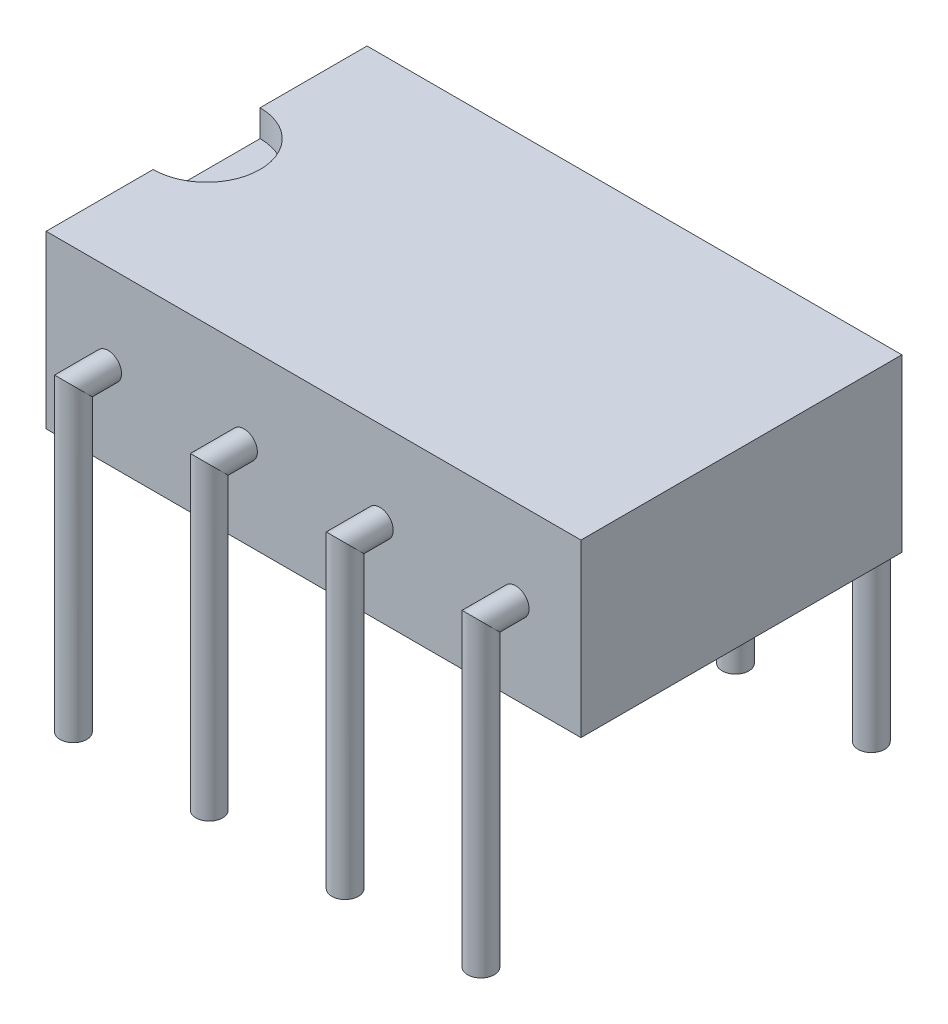
ISO-10303-21;
HEADER;
FILE_DESCRIPTION(('STEP AP214'),'2;1');
FILE_NAME('part.step','',(''),(''),'','','');
FILE_SCHEMA(('AUTOMOTIVE_DESIGN { 1 0 10303 214 1 1 1 1 }'));
ENDSEC;
DATA;
#1=APPLICATION_CONTEXT('core data for automotive mechanical design processes');
#2=APPLICATION_PROTOCOL_DEFINITION('international standard','automotive_design',2000,#1);
#3=PRODUCT_CONTEXT('',#1,'mechanical');
#4=PRODUCT('Part','Part','',(#3));
#5=PRODUCT_RELATED_PRODUCT_CATEGORY('part','',(#4));
#6=PRODUCT_DEFINITION_FORMATION('','',#4);
#7=PRODUCT_DEFINITION_CONTEXT('part definition',#1,'design');
#8=PRODUCT_DEFINITION('design','',#6,#7);
#9=PRODUCT_DEFINITION_SHAPE('','',#8);
#10=(LENGTH_UNIT() NAMED_UNIT(*) SI_UNIT(.MILLI.,.METRE.));
#11=(NAMED_UNIT(*) PLANE_ANGLE_UNIT() SI_UNIT($,.RADIAN.));
#12=(NAMED_UNIT(*) SI_UNIT($,.STERADIAN.) SOLID_ANGLE_UNIT());
#13=UNCERTAINTY_MEASURE_WITH_UNIT(LENGTH_MEASURE(1.E-05),#10,'distance_accuracy_value','');
#14=(GEOMETRIC_REPRESENTATION_CONTEXT(3) GLOBAL_UNCERTAINTY_ASSIGNED_CONTEXT((#13)) GLOBAL_UNIT_ASSIGNED_CONTEXT((#10,
#11,#12)) REPRESENTATION_CONTEXT('',''));
#15=CARTESIAN_POINT('',(0.,0.,0.));
#16=DIRECTION('',(0.,0.,1.));
#17=DIRECTION('',(1.,0.,0.));
#18=AXIS2_PLACEMENT_3D('',#15,#16,#17);
#19=CARTESIAN_POINT('',(10.,3.2,3.));
#20=DIRECTION('',(0.,0.,-1.));
#21=DIRECTION('',(-1.,0.,0.));
#22=AXIS2_PLACEMENT_3D('',#19,#20,#21);
#23=PLANE('',#22);
#24=CARTESIAN_POINT('',(6.24,1.6,3.));
#25=DIRECTION('',(0.,0.,-1.));
#26=DIRECTION('',(-1.,0.,0.));
#27=AXIS2_PLACEMENT_3D('',#24,#25,#26);
#28=CIRCLE('',#27,0.25);
#29=CARTESIAN_POINT('',(5.99,1.6,3.));
#30=VERTEX_POINT('',#29);
#31=EDGE_CURVE('E43',#30,#30,#28,.F.);
#32=ORIENTED_EDGE('',*,*,#31,.F.);
#33=EDGE_LOOP('',(#32));
#34=FACE_BOUND('',#33,.T.);
#35=CARTESIAN_POINT('',(1.16,1.6,3.));
#36=DIRECTION('',(0.,0.,1.));
#37=DIRECTION('',(1.,0.,0.));
#38=AXIS2_PLACEMENT_3D('',#35,#36,#37);
#39=CIRCLE('',#38,0.25);
#40=CARTESIAN_POINT('',(1.41,1.6,3.));
#41=VERTEX_POINT('',#40);
#42=EDGE_CURVE('E134',#41,#41,#39,.T.);
#43=ORIENTED_EDGE('',*,*,#42,.F.);
#44=EDGE_LOOP('',(#43));
#45=FACE_BOUND('',#44,.T.);
#46=DIRECTION('',(0.,-1.,0.));
#47=VECTOR('',#46,1.);
#48=CARTESIAN_POINT('',(0.,3.2,3.));
#49=LINE('',#48,#47);
#50=CARTESIAN_POINT('',(0.,3.2,3.));
#51=VERTEX_POINT('',#50);
#52=CARTESIAN_POINT('',(0.,0.,3.));
#53=VERTEX_POINT('',#52);
#54=EDGE_CURVE('E153',#51,#53,#49,.T.);
#55=ORIENTED_EDGE('',*,*,#54,.T.);
#56=DIRECTION('',(-1.,0.,0.));
#57=VECTOR('',#56,1.);
#58=CARTESIAN_POINT('',(10.,0.,3.));
#59=LINE('',#58,#57);
#60=CARTESIAN_POINT('',(10.,0.,3.));
#61=VERTEX_POINT('',#60);
#62=EDGE_CURVE('E131',#61,#53,#59,.T.);
#63=ORIENTED_EDGE('',*,*,#62,.F.);
#64=DIRECTION('',(0.,-1.,0.));
#65=VECTOR('',#64,1.);
#66=CARTESIAN_POINT('',(10.,3.2,3.));
#67=LINE('',#66,#65);
#68=CARTESIAN_POINT('',(10.,3.2,3.));
#69=VERTEX_POINT('',#68);
#70=EDGE_CURVE('E111',#69,#61,#67,.T.);
#71=ORIENTED_EDGE('',*,*,#70,.F.);
#72=DIRECTION('',(-1.,0.,0.));
#73=VECTOR('',#72,1.);
#74=CARTESIAN_POINT('',(10.,3.2,3.));
#75=LINE('',#74,#73);
#76=EDGE_CURVE('E124',#69,#51,#75,.T.);
#77=ORIENTED_EDGE('',*,*,#76,.T.);
#78=EDGE_LOOP('',(#55,#63,#71,#77));
#79=FACE_BOUND('',#78,.T.);
#80=CARTESIAN_POINT('',(3.7,1.6,3.));
#81=DIRECTION('',(0.,0.,-1.));
#82=DIRECTION('',(-1.,0.,0.));
#83=AXIS2_PLACEMENT_3D('',#80,#81,#82);
#84=CIRCLE('',#83,0.25);
#85=CARTESIAN_POINT('',(3.45,1.6,3.));
#86=VERTEX_POINT('',#85);
#87=EDGE_CURVE('E135',#86,#86,#84,.F.);
#88=ORIENTED_EDGE('',*,*,#87,.F.);
#89=EDGE_LOOP('',(#88));
#90=FACE_BOUND('',#89,.T.);
#91=CARTESIAN_POINT('',(8.78,1.6,3.));
#92=DIRECTION('',(0.,0.,-1.));
#93=DIRECTION('',(-1.,0.,0.));
#94=AXIS2_PLACEMENT_3D('',#91,#92,#93);
#95=CIRCLE('',#94,0.25);
#96=CARTESIAN_POINT('',(8.53,1.6,3.));
#97=VERTEX_POINT('',#96);
#98=EDGE_CURVE('E12',#97,#97,#95,.F.);
#99=ORIENTED_EDGE('',*,*,#98,.F.);
#100=EDGE_LOOP('',(#99));
#101=FACE_BOUND('',#100,.T.);
#102=ADVANCED_FACE('F36',(#34,#45,#79,#90,#101),#23,.F.);
#103=CARTESIAN_POINT('',(10.,0.,3.));
#104=DIRECTION('',(0.,1.,0.));
#105=DIRECTION('',(0.,0.,1.));
#106=AXIS2_PLACEMENT_3D('',#103,#104,#105);
#107=PLANE('',#106);
#108=DIRECTION('',(0.,0.,-1.));
#109=VECTOR('',#108,1.);
#110=CARTESIAN_POINT('',(0.,0.,3.));
#111=LINE('',#110,#109);
#112=CARTESIAN_POINT('',(0.,0.,-3.));
#113=VERTEX_POINT('',#112);
#114=EDGE_CURVE('E208',#53,#113,#111,.T.);
#115=ORIENTED_EDGE('',*,*,#114,.T.);
#116=DIRECTION('',(-1.,0.,0.));
#117=VECTOR('',#116,1.);
#118=CARTESIAN_POINT('',(10.,0.,-3.));
#119=LINE('',#118,#117);
#120=CARTESIAN_POINT('',(10.,0.,-3.));
#121=VERTEX_POINT('',#120);
#122=EDGE_CURVE('E128',#121,#113,#119,.T.);
#123=ORIENTED_EDGE('',*,*,#122,.F.);
#124=DIRECTION('',(0.,0.,-1.));
#125=VECTOR('',#124,1.);
#126=CARTESIAN_POINT('',(10.,0.,3.));
#127=LINE('',#126,#125);
#128=EDGE_CURVE('E114',#61,#121,#127,.T.);
#129=ORIENTED_EDGE('',*,*,#128,.F.);
#130=ORIENTED_EDGE('',*,*,#62,.T.);
#131=EDGE_LOOP('',(#115,#123,#129,#130));
#132=FACE_BOUND('',#131,.T.);
#133=ADVANCED_FACE('F145',(#132),#107,.F.);
#134=CARTESIAN_POINT('',(10.,3.2,-3.));
#135=DIRECTION('',(0.,0.,1.));
#136=DIRECTION('',(1.,0.,0.));
#137=AXIS2_PLACEMENT_3D('',#134,#135,#136);
#138=PLANE('',#137);
#139=CARTESIAN_POINT('',(8.78,1.6,-3.));
#140=DIRECTION('',(0.,0.,1.));
#141=DIRECTION('',(1.,0.,0.));
#142=AXIS2_PLACEMENT_3D('',#139,#140,#141);
#143=CIRCLE('',#142,0.25);
#144=CARTESIAN_POINT('',(9.03,1.6,-3.));
#145=VERTEX_POINT('',#144);
#146=EDGE_CURVE('E457',#145,#145,#143,.T.);
#147=ORIENTED_EDGE('',*,*,#146,.T.);
#148=EDGE_LOOP('',(#147));
#149=FACE_BOUND('',#148,.T.);
#150=CARTESIAN_POINT('',(6.24,1.6,-3.));
#151=DIRECTION('',(0.,0.,1.));
#152=DIRECTION('',(1.,0.,0.));
#153=AXIS2_PLACEMENT_3D('',#150,#151,#152);
#154=CIRCLE('',#153,0.25);
#155=CARTESIAN_POINT('',(6.49,1.6,-3.));
#156=VERTEX_POINT('',#155);
#157=EDGE_CURVE('E450',#156,#156,#154,.T.);
#158=ORIENTED_EDGE('',*,*,#157,.T.);
#159=EDGE_LOOP('',(#158));
#160=FACE_BOUND('',#159,.T.);
#161=CARTESIAN_POINT('',(3.7,1.6,-3.));
#162=DIRECTION('',(0.,0.,1.));
#163=DIRECTION('',(1.,0.,0.));
#164=AXIS2_PLACEMENT_3D('',#161,#162,#163);
#165=CIRCLE('',#164,0.25);
#166=CARTESIAN_POINT('',(3.95,1.6,-3.));
#167=VERTEX_POINT('',#166);
#168=EDGE_CURVE('E466',#167,#167,#165,.T.);
#169=ORIENTED_EDGE('',*,*,#168,.T.);
#170=EDGE_LOOP('',(#169));
#171=FACE_BOUND('',#170,.T.);
#172=CARTESIAN_POINT('',(1.16,1.6,-3.));
#173=DIRECTION('',(0.,0.,1.));
#174=DIRECTION('',(1.,0.,0.));
#175=AXIS2_PLACEMENT_3D('',#172,#173,#174);
#176=CIRCLE('',#175,0.25);
#177=CARTESIAN_POINT('',(1.41,1.6,-3.));
#178=VERTEX_POINT('',#177);
#179=EDGE_CURVE('E190',#178,#178,#176,.T.);
#180=ORIENTED_EDGE('',*,*,#179,.T.);
#181=EDGE_LOOP('',(#180));
#182=FACE_BOUND('',#181,.T.);
#183=DIRECTION('',(0.,1.,0.));
#184=VECTOR('',#183,1.);
#185=CARTESIAN_POINT('',(0.,3.2,-3.));
#186=LINE('',#185,#184);
#187=CARTESIAN_POINT('',(0.,3.2,-3.));
#188=VERTEX_POINT('',#187);
#189=EDGE_CURVE('E116',#113,#188,#186,.T.);
#190=ORIENTED_EDGE('',*,*,#189,.T.);
#191=DIRECTION('',(-1.,0.,0.));
#192=VECTOR('',#191,1.);
#193=CARTESIAN_POINT('',(10.,3.2,-3.));
#194=LINE('',#193,#192);
#195=CARTESIAN_POINT('',(10.,3.2,-3.));
#196=VERTEX_POINT('',#195);
#197=EDGE_CURVE('E110',#196,#188,#194,.T.);
#198=ORIENTED_EDGE('',*,*,#197,.F.);
#199=DIRECTION('',(0.,1.,0.));
#200=VECTOR('',#199,1.);
#201=CARTESIAN_POINT('',(10.,3.2,-3.));
#202=LINE('',#201,#200);
#203=EDGE_CURVE('E121',#121,#196,#202,.T.);
#204=ORIENTED_EDGE('',*,*,#203,.F.);
#205=ORIENTED_EDGE('',*,*,#122,.T.);
#206=EDGE_LOOP('',(#190,#198,#204,#205));
#207=FACE_BOUND('',#206,.T.);
#208=ADVANCED_FACE('F212',(#149,#160,#171,#182,#207),#138,.F.);
#209=CARTESIAN_POINT('',(10.,3.2,3.));
#210=DIRECTION('',(0.,-1.,0.));
#211=DIRECTION('',(0.,0.,-1.));
#212=AXIS2_PLACEMENT_3D('',#209,#210,#211);
#213=PLANE('',#212);
#214=DIRECTION('',(0.,0.,1.));
#215=VECTOR('',#214,1.);
#216=CARTESIAN_POINT('',(0.,3.2,3.));
#217=LINE('',#216,#215);
#218=CARTESIAN_POINT('',(0.,3.2,-1.));
#219=VERTEX_POINT('',#218);
#220=EDGE_CURVE('E104',#188,#219,#217,.T.);
#221=ORIENTED_EDGE('',*,*,#220,.T.);
#222=CARTESIAN_POINT('',(0.,3.2,0.));
#223=DIRECTION('',(0.,1.,0.));
#224=DIRECTION('',(0.,0.,1.));
#225=AXIS2_PLACEMENT_3D('',#222,#223,#224);
#226=CIRCLE('',#225,1.);
#227=CARTESIAN_POINT('',(0.,3.2,1.));
#228=VERTEX_POINT('',#227);
#229=EDGE_CURVE('E88',#228,#219,#226,.T.);
#230=ORIENTED_EDGE('',*,*,#229,.F.);
#231=EDGE_CURVE('E112',#228,#51,#217,.T.);
#232=ORIENTED_EDGE('',*,*,#231,.T.);
#233=ORIENTED_EDGE('',*,*,#76,.F.);
#234=DIRECTION('',(0.,0.,1.));
#235=VECTOR('',#234,1.);
#236=CARTESIAN_POINT('',(10.,3.2,3.));
#237=LINE('',#236,#235);
#238=EDGE_CURVE('E57',#196,#69,#237,.T.);
#239=ORIENTED_EDGE('',*,*,#238,.F.);
#240=ORIENTED_EDGE('',*,*,#197,.T.);
#241=EDGE_LOOP('',(#221,#230,#232,#233,#239,#240));
#242=FACE_BOUND('',#241,.T.);
#243=ADVANCED_FACE('F108',(#242),#213,.F.);
#244=CARTESIAN_POINT('',(10.,0.,3.));
#245=DIRECTION('',(1.,0.,0.));
#246=DIRECTION('',(0.,0.,-1.));
#247=AXIS2_PLACEMENT_3D('',#244,#245,#246);
#248=PLANE('',#247);
#249=ORIENTED_EDGE('',*,*,#70,.T.);
#250=ORIENTED_EDGE('',*,*,#128,.T.);
#251=ORIENTED_EDGE('',*,*,#203,.T.);
#252=ORIENTED_EDGE('',*,*,#238,.T.);
#253=EDGE_LOOP('',(#249,#250,#251,#252));
#254=FACE_BOUND('',#253,.T.);
#255=ADVANCED_FACE('F215',(#254),#248,.T.);
#256=CARTESIAN_POINT('',(0.,0.,3.));
#257=DIRECTION('',(1.,0.,0.));
#258=DIRECTION('',(0.,0.,-1.));
#259=AXIS2_PLACEMENT_3D('',#256,#257,#258);
#260=PLANE('',#259);
#261=DIRECTION('',(0.,0.,1.));
#262=VECTOR('',#261,1.);
#263=CARTESIAN_POINT('',(0.,2.7,-1.));
#264=LINE('',#263,#262);
#265=CARTESIAN_POINT('',(0.,2.7,-1.));
#266=VERTEX_POINT('',#265);
#267=CARTESIAN_POINT('',(0.,2.7,1.));
#268=VERTEX_POINT('',#267);
#269=EDGE_CURVE('E105',#266,#268,#264,.T.);
#270=ORIENTED_EDGE('',*,*,#269,.F.);
#271=DIRECTION('',(0.,1.,0.));
#272=VECTOR('',#271,1.);
#273=CARTESIAN_POINT('',(0.,2.7,-1.));
#274=LINE('',#273,#272);
#275=EDGE_CURVE('E91',#266,#219,#274,.T.);
#276=ORIENTED_EDGE('',*,*,#275,.T.);
#277=ORIENTED_EDGE('',*,*,#220,.F.);
#278=ORIENTED_EDGE('',*,*,#189,.F.);
#279=ORIENTED_EDGE('',*,*,#114,.F.);
#280=ORIENTED_EDGE('',*,*,#54,.F.);
#281=ORIENTED_EDGE('',*,*,#231,.F.);
#282=DIRECTION('',(0.,1.,0.));
#283=VECTOR('',#282,1.);
#284=CARTESIAN_POINT('',(0.,2.7,1.));
#285=LINE('',#284,#283);
#286=EDGE_CURVE('E94',#268,#228,#285,.T.);
#287=ORIENTED_EDGE('',*,*,#286,.F.);
#288=EDGE_LOOP('',(#270,#276,#277,#278,#279,#280,#281,#287));
#289=FACE_BOUND('',#288,.T.);
#290=ADVANCED_FACE('F102',(#289),#260,.F.);
#291=CARTESIAN_POINT('',(0.,2.7,0.));
#292=DIRECTION('',(0.,1.,0.));
#293=DIRECTION('',(0.,0.,1.));
#294=AXIS2_PLACEMENT_3D('',#291,#292,#293);
#295=CYLINDRICAL_SURFACE('',#294,1.);
#296=ORIENTED_EDGE('',*,*,#229,.T.);
#297=ORIENTED_EDGE('',*,*,#275,.F.);
#298=CARTESIAN_POINT('',(0.,2.7,0.));
#299=DIRECTION('',(0.,1.,0.));
#300=DIRECTION('',(0.,0.,1.));
#301=AXIS2_PLACEMENT_3D('',#298,#299,#300);
#302=CIRCLE('',#301,1.);
#303=EDGE_CURVE('E49',#268,#266,#302,.T.);
#304=ORIENTED_EDGE('',*,*,#303,.F.);
#305=ORIENTED_EDGE('',*,*,#286,.T.);
#306=EDGE_LOOP('',(#296,#297,#304,#305));
#307=FACE_BOUND('',#306,.T.);
#308=ADVANCED_FACE('F90',(#307),#295,.F.);
#309=CARTESIAN_POINT('',(0.,2.7,0.));
#310=DIRECTION('',(0.,1.,0.));
#311=DIRECTION('',(0.,0.,1.));
#312=AXIS2_PLACEMENT_3D('',#309,#310,#311);
#313=PLANE('',#312);
#314=ORIENTED_EDGE('',*,*,#303,.T.);
#315=ORIENTED_EDGE('',*,*,#269,.T.);
#316=EDGE_LOOP('',(#314,#315));
#317=FACE_BOUND('',#316,.T.);
#318=ADVANCED_FACE('F253',(#317),#313,.T.);
#319=CARTESIAN_POINT('',(1.16,1.6,3.65));
#320=DIRECTION('',(0.,-1.,0.));
#321=DIRECTION('',(0.,0.,-1.));
#322=AXIS2_PLACEMENT_3D('',#319,#320,#321);
#323=CYLINDRICAL_SURFACE('',#322,0.25);
#324=CARTESIAN_POINT('',(1.16,1.6,3.65));
#325=DIRECTION('',(0.,-0.707106781186548,0.707106781186547));
#326=DIRECTION('',(0.,-0.707106781186547,-0.707106781186548));
#327=AXIS2_PLACEMENT_3D('',#324,#325,#326);
#328=ELLIPSE('',#327,0.353553390593274,0.25);
#329=CARTESIAN_POINT('',(1.16,1.35,3.4));
#330=VERTEX_POINT('',#329);
#331=EDGE_CURVE('E199',#330,#330,#328,.T.);
#332=ORIENTED_EDGE('',*,*,#331,.T.);
#333=EDGE_LOOP('',(#332));
#334=FACE_BOUND('',#333,.T.);
#335=CARTESIAN_POINT('',(1.16,-4.,3.65));
#336=DIRECTION('',(0.,-1.,0.));
#337=DIRECTION('',(0.,0.,-1.));
#338=AXIS2_PLACEMENT_3D('',#335,#336,#337);
#339=CIRCLE('',#338,0.25);
#340=CARTESIAN_POINT('',(1.16,-4.,3.4));
#341=VERTEX_POINT('',#340);
#342=EDGE_CURVE('E98',#341,#341,#339,.F.);
#343=ORIENTED_EDGE('',*,*,#342,.T.);
#344=EDGE_LOOP('',(#343));
#345=FACE_BOUND('',#344,.T.);
#346=ADVANCED_FACE('F259',(#334,#345),#323,.T.);
#347=CARTESIAN_POINT('',(1.16,1.6,4.35710678118655));
#348=DIRECTION('',(0.,0.,-1.));
#349=DIRECTION('',(0.,1.,0.));
#350=AXIS2_PLACEMENT_3D('',#347,#348,#349);
#351=CYLINDRICAL_SURFACE('',#350,0.25);
#352=ORIENTED_EDGE('',*,*,#42,.T.);
#353=EDGE_LOOP('',(#352));
#354=FACE_BOUND('',#353,.T.);
#355=ORIENTED_EDGE('',*,*,#331,.F.);
#356=EDGE_LOOP('',(#355));
#357=FACE_BOUND('',#356,.T.);
#358=ADVANCED_FACE('F266',(#354,#357),#351,.T.);
#359=CARTESIAN_POINT('',(1.16,-4.,3.65));
#360=DIRECTION('',(0.,-1.,0.));
#361=DIRECTION('',(0.,0.,-1.));
#362=AXIS2_PLACEMENT_3D('',#359,#360,#361);
#363=PLANE('',#362);
#364=ORIENTED_EDGE('',*,*,#342,.F.);
#365=EDGE_LOOP('',(#364));
#366=FACE_BOUND('',#365,.T.);
#367=ADVANCED_FACE('F274',(#366),#363,.T.);
#368=CARTESIAN_POINT('',(1.16,1.6,-3.65));
#369=DIRECTION('',(0.,-1.,0.));
#370=DIRECTION('',(0.,0.,-1.));
#371=AXIS2_PLACEMENT_3D('',#368,#369,#370);
#372=CYLINDRICAL_SURFACE('',#371,0.25);
#373=CARTESIAN_POINT('',(1.16,1.6,-3.65));
#374=DIRECTION('',(0.,-0.707106781186548,-0.707106781186547));
#375=DIRECTION('',(0.,-0.707106781186547,0.707106781186548));
#376=AXIS2_PLACEMENT_3D('',#373,#374,#375);
#377=ELLIPSE('',#376,0.353553390593274,0.25);
#378=CARTESIAN_POINT('',(1.16,1.35,-3.4));
#379=VERTEX_POINT('',#378);
#380=EDGE_CURVE('E193',#379,#379,#377,.F.);
#381=ORIENTED_EDGE('',*,*,#380,.F.);
#382=EDGE_LOOP('',(#381));
#383=FACE_BOUND('',#382,.T.);
#384=CARTESIAN_POINT('',(1.16,-4.,-3.65));
#385=DIRECTION('',(0.,-1.,0.));
#386=DIRECTION('',(0.,0.,-1.));
#387=AXIS2_PLACEMENT_3D('',#384,#385,#386);
#388=CIRCLE('',#387,0.25);
#389=CARTESIAN_POINT('',(1.16,-4.,-3.9));
#390=VERTEX_POINT('',#389);
#391=EDGE_CURVE('E196',#390,#390,#388,.T.);
#392=ORIENTED_EDGE('',*,*,#391,.F.);
#393=EDGE_LOOP('',(#392));
#394=FACE_BOUND('',#393,.T.);
#395=ADVANCED_FACE('F282',(#383,#394),#372,.T.);
#396=CARTESIAN_POINT('',(1.16,1.6,-4.35710678118655));
#397=DIRECTION('',(0.,0.,1.));
#398=DIRECTION('',(0.,-1.,0.));
#399=AXIS2_PLACEMENT_3D('',#396,#397,#398);
#400=CYLINDRICAL_SURFACE('',#399,0.25);
#401=ORIENTED_EDGE('',*,*,#179,.F.);
#402=EDGE_LOOP('',(#401));
#403=FACE_BOUND('',#402,.T.);
#404=ORIENTED_EDGE('',*,*,#380,.T.);
#405=EDGE_LOOP('',(#404));
#406=FACE_BOUND('',#405,.T.);
#407=ADVANCED_FACE('F290',(#403,#406),#400,.T.);
#408=CARTESIAN_POINT('',(1.16,-4.,-3.65));
#409=DIRECTION('',(0.,-1.,0.));
#410=DIRECTION('',(0.,0.,-1.));
#411=AXIS2_PLACEMENT_3D('',#408,#409,#410);
#412=PLANE('',#411);
#413=ORIENTED_EDGE('',*,*,#391,.T.);
#414=EDGE_LOOP('',(#413));
#415=FACE_BOUND('',#414,.T.);
#416=ADVANCED_FACE('F298',(#415),#412,.T.);
#417=CARTESIAN_POINT('',(3.7,1.6,3.65));
#418=DIRECTION('',(0.,-1.,0.));
#419=DIRECTION('',(0.,0.,-1.));
#420=AXIS2_PLACEMENT_3D('',#417,#418,#419);
#421=CYLINDRICAL_SURFACE('',#420,0.25);
#422=CARTESIAN_POINT('',(3.7,1.6,3.65));
#423=DIRECTION('',(0.,-0.707106781186548,0.707106781186547));
#424=DIRECTION('',(0.,-0.707106781186547,-0.707106781186548));
#425=AXIS2_PLACEMENT_3D('',#422,#423,#424);
#426=ELLIPSE('',#425,0.353553390593274,0.25);
#427=CARTESIAN_POINT('',(3.7,1.35,3.4));
#428=VERTEX_POINT('',#427);
#429=EDGE_CURVE('E184',#428,#428,#426,.T.);
#430=ORIENTED_EDGE('',*,*,#429,.T.);
#431=EDGE_LOOP('',(#430));
#432=FACE_BOUND('',#431,.T.);
#433=CARTESIAN_POINT('',(3.7,-4.,3.65));
#434=DIRECTION('',(0.,-1.,0.));
#435=DIRECTION('',(0.,0.,-1.));
#436=AXIS2_PLACEMENT_3D('',#433,#434,#435);
#437=CIRCLE('',#436,0.25);
#438=CARTESIAN_POINT('',(3.7,-4.,3.4));
#439=VERTEX_POINT('',#438);
#440=EDGE_CURVE('E187',#439,#439,#437,.F.);
#441=ORIENTED_EDGE('',*,*,#440,.T.);
#442=EDGE_LOOP('',(#441));
#443=FACE_BOUND('',#442,.T.);
#444=ADVANCED_FACE('F306',(#432,#443),#421,.T.);
#445=CARTESIAN_POINT('',(3.7,1.6,4.35710678118655));
#446=DIRECTION('',(0.,0.,-1.));
#447=DIRECTION('',(0.,1.,0.));
#448=AXIS2_PLACEMENT_3D('',#445,#446,#447);
#449=CYLINDRICAL_SURFACE('',#448,0.25);
#450=ORIENTED_EDGE('',*,*,#87,.T.);
#451=EDGE_LOOP('',(#450));
#452=FACE_BOUND('',#451,.T.);
#453=ORIENTED_EDGE('',*,*,#429,.F.);
#454=EDGE_LOOP('',(#453));
#455=FACE_BOUND('',#454,.T.);
#456=ADVANCED_FACE('F317',(#452,#455),#449,.T.);
#457=CARTESIAN_POINT('',(3.7,-4.,3.65));
#458=DIRECTION('',(0.,-1.,0.));
#459=DIRECTION('',(0.,0.,-1.));
#460=AXIS2_PLACEMENT_3D('',#457,#458,#459);
#461=PLANE('',#460);
#462=ORIENTED_EDGE('',*,*,#440,.F.);
#463=EDGE_LOOP('',(#462));
#464=FACE_BOUND('',#463,.T.);
#465=ADVANCED_FACE('F325',(#464),#461,.T.);
#466=CARTESIAN_POINT('',(6.24,1.6,3.65));
#467=DIRECTION('',(0.,-1.,0.));
#468=DIRECTION('',(0.,0.,-1.));
#469=AXIS2_PLACEMENT_3D('',#466,#467,#468);
#470=CYLINDRICAL_SURFACE('',#469,0.25);
#471=CARTESIAN_POINT('',(6.24,1.6,3.65));
#472=DIRECTION('',(0.,-0.707106781186548,0.707106781186547));
#473=DIRECTION('',(0.,-0.707106781186547,-0.707106781186548));
#474=AXIS2_PLACEMENT_3D('',#471,#472,#473);
#475=ELLIPSE('',#474,0.353553390593274,0.25);
#476=CARTESIAN_POINT('',(6.24,1.35,3.4));
#477=VERTEX_POINT('',#476);
#478=EDGE_CURVE('E172',#477,#477,#475,.T.);
#479=ORIENTED_EDGE('',*,*,#478,.T.);
#480=EDGE_LOOP('',(#479));
#481=FACE_BOUND('',#480,.T.);
#482=CARTESIAN_POINT('',(6.24,-4.,3.65));
#483=DIRECTION('',(0.,-1.,0.));
#484=DIRECTION('',(0.,0.,-1.));
#485=AXIS2_PLACEMENT_3D('',#482,#483,#484);
#486=CIRCLE('',#485,0.25);
#487=CARTESIAN_POINT('',(6.24,-4.,3.4));
#488=VERTEX_POINT('',#487);
#489=EDGE_CURVE('E181',#488,#488,#486,.F.);
#490=ORIENTED_EDGE('',*,*,#489,.T.);
#491=EDGE_LOOP('',(#490));
#492=FACE_BOUND('',#491,.T.);
#493=ADVANCED_FACE('F333',(#481,#492),#470,.T.);
#494=CARTESIAN_POINT('',(6.24,1.6,4.35710678118655));
#495=DIRECTION('',(0.,0.,-1.));
#496=DIRECTION('',(0.,1.,0.));
#497=AXIS2_PLACEMENT_3D('',#494,#495,#496);
#498=CYLINDRICAL_SURFACE('',#497,0.25);
#499=ORIENTED_EDGE('',*,*,#31,.T.);
#500=EDGE_LOOP('',(#499));
#501=FACE_BOUND('',#500,.T.);
#502=ORIENTED_EDGE('',*,*,#478,.F.);
#503=EDGE_LOOP('',(#502));
#504=FACE_BOUND('',#503,.T.);
#505=ADVANCED_FACE('F140',(#501,#504),#498,.T.);
#506=CARTESIAN_POINT('',(6.24,-4.,3.65));
#507=DIRECTION('',(0.,-1.,0.));
#508=DIRECTION('',(0.,0.,-1.));
#509=AXIS2_PLACEMENT_3D('',#506,#507,#508);
#510=PLANE('',#509);
#511=ORIENTED_EDGE('',*,*,#489,.F.);
#512=EDGE_LOOP('',(#511));
#513=FACE_BOUND('',#512,.T.);
#514=ADVANCED_FACE('F348',(#513),#510,.T.);
#515=CARTESIAN_POINT('',(8.78,1.6,3.65));
#516=DIRECTION('',(0.,-1.,0.));
#517=DIRECTION('',(0.,0.,-1.));
#518=AXIS2_PLACEMENT_3D('',#515,#516,#517);
#519=CYLINDRICAL_SURFACE('',#518,0.25);
#520=CARTESIAN_POINT('',(8.78,1.6,3.65));
#521=DIRECTION('',(0.,-0.707106781186548,0.707106781186547));
#522=DIRECTION('',(0.,-0.707106781186547,-0.707106781186548));
#523=AXIS2_PLACEMENT_3D('',#520,#521,#522);
#524=ELLIPSE('',#523,0.353553390593274,0.25);
#525=CARTESIAN_POINT('',(8.78,1.35,3.4));
#526=VERTEX_POINT('',#525);
#527=EDGE_CURVE('E166',#526,#526,#524,.T.);
#528=ORIENTED_EDGE('',*,*,#527,.T.);
#529=EDGE_LOOP('',(#528));
#530=FACE_BOUND('',#529,.T.);
#531=CARTESIAN_POINT('',(8.78,-4.,3.65));
#532=DIRECTION('',(0.,-1.,0.));
#533=DIRECTION('',(0.,0.,-1.));
#534=AXIS2_PLACEMENT_3D('',#531,#532,#533);
#535=CIRCLE('',#534,0.25);
#536=CARTESIAN_POINT('',(8.78,-4.,3.4));
#537=VERTEX_POINT('',#536);
#538=EDGE_CURVE('E168',#537,#537,#535,.F.);
#539=ORIENTED_EDGE('',*,*,#538,.T.);
#540=EDGE_LOOP('',(#539));
#541=FACE_BOUND('',#540,.T.);
#542=ADVANCED_FACE('F162',(#530,#541),#519,.T.);
#543=CARTESIAN_POINT('',(8.78,1.6,4.35710678118655));
#544=DIRECTION('',(0.,0.,-1.));
#545=DIRECTION('',(0.,1.,0.));
#546=AXIS2_PLACEMENT_3D('',#543,#544,#545);
#547=CYLINDRICAL_SURFACE('',#546,0.25);
#548=ORIENTED_EDGE('',*,*,#98,.T.);
#549=EDGE_LOOP('',(#548));
#550=FACE_BOUND('',#549,.T.);
#551=ORIENTED_EDGE('',*,*,#527,.F.);
#552=EDGE_LOOP('',(#551));
#553=FACE_BOUND('',#552,.T.);
#554=ADVANCED_FACE('F158',(#550,#553),#547,.T.);
#555=CARTESIAN_POINT('',(8.78,-4.,3.65));
#556=DIRECTION('',(0.,-1.,0.));
#557=DIRECTION('',(0.,0.,-1.));
#558=AXIS2_PLACEMENT_3D('',#555,#556,#557);
#559=PLANE('',#558);
#560=ORIENTED_EDGE('',*,*,#538,.F.);
#561=EDGE_LOOP('',(#560));
#562=FACE_BOUND('',#561,.T.);
#563=ADVANCED_FACE('F161',(#562),#559,.T.);
#564=CARTESIAN_POINT('',(3.7,1.6,-3.65));
#565=DIRECTION('',(0.,-1.,0.));
#566=DIRECTION('',(0.,0.,-1.));
#567=AXIS2_PLACEMENT_3D('',#564,#565,#566);
#568=CYLINDRICAL_SURFACE('',#567,0.25);
#569=CARTESIAN_POINT('',(3.7,1.6,-3.65));
#570=DIRECTION('',(0.,-0.707106781186548,-0.707106781186547));
#571=DIRECTION('',(0.,-0.707106781186547,0.707106781186548));
#572=AXIS2_PLACEMENT_3D('',#569,#570,#571);
#573=ELLIPSE('',#572,0.353553390593274,0.25);
#574=CARTESIAN_POINT('',(3.7,1.35,-3.4));
#575=VERTEX_POINT('',#574);
#576=EDGE_CURVE('E175',#575,#575,#573,.F.);
#577=ORIENTED_EDGE('',*,*,#576,.F.);
#578=EDGE_LOOP('',(#577));
#579=FACE_BOUND('',#578,.T.);
#580=CARTESIAN_POINT('',(3.7,-4.,-3.65));
#581=DIRECTION('',(0.,-1.,0.));
#582=DIRECTION('',(0.,0.,-1.));
#583=AXIS2_PLACEMENT_3D('',#580,#581,#582);
#584=CIRCLE('',#583,0.25);
#585=CARTESIAN_POINT('',(3.7,-4.,-3.9));
#586=VERTEX_POINT('',#585);
#587=EDGE_CURVE('E169',#586,#586,#584,.T.);
#588=ORIENTED_EDGE('',*,*,#587,.F.);
#589=EDGE_LOOP('',(#588));
#590=FACE_BOUND('',#589,.T.);
#591=ADVANCED_FACE('F372',(#579,#590),#568,.T.);
#592=CARTESIAN_POINT('',(3.7,1.6,-4.35710678118655));
#593=DIRECTION('',(0.,0.,1.));
#594=DIRECTION('',(0.,-1.,0.));
#595=AXIS2_PLACEMENT_3D('',#592,#593,#594);
#596=CYLINDRICAL_SURFACE('',#595,0.25);
#597=ORIENTED_EDGE('',*,*,#168,.F.);
#598=EDGE_LOOP('',(#597));
#599=FACE_BOUND('',#598,.T.);
#600=ORIENTED_EDGE('',*,*,#576,.T.);
#601=EDGE_LOOP('',(#600));
#602=FACE_BOUND('',#601,.T.);
#603=ADVANCED_FACE('F380',(#599,#602),#596,.T.);
#604=CARTESIAN_POINT('',(3.7,-4.,-3.65));
#605=DIRECTION('',(0.,-1.,0.));
#606=DIRECTION('',(0.,0.,-1.));
#607=AXIS2_PLACEMENT_3D('',#604,#605,#606);
#608=PLANE('',#607);
#609=ORIENTED_EDGE('',*,*,#587,.T.);
#610=EDGE_LOOP('',(#609));
#611=FACE_BOUND('',#610,.T.);
#612=ADVANCED_FACE('F388',(#611),#608,.T.);
#613=CARTESIAN_POINT('',(6.24,1.6,-3.65));
#614=DIRECTION('',(0.,-1.,0.));
#615=DIRECTION('',(0.,0.,-1.));
#616=AXIS2_PLACEMENT_3D('',#613,#614,#615);
#617=CYLINDRICAL_SURFACE('',#616,0.25);
#618=CARTESIAN_POINT('',(6.24,1.6,-3.65));
#619=DIRECTION('',(0.,-0.707106781186548,-0.707106781186547));
#620=DIRECTION('',(0.,-0.707106781186547,0.707106781186548));
#621=AXIS2_PLACEMENT_3D('',#618,#619,#620);
#622=ELLIPSE('',#621,0.353553390593274,0.25);
#623=CARTESIAN_POINT('',(6.24,1.35,-3.4));
#624=VERTEX_POINT('',#623);
#625=EDGE_CURVE('E454',#624,#624,#622,.F.);
#626=ORIENTED_EDGE('',*,*,#625,.F.);
#627=EDGE_LOOP('',(#626));
#628=FACE_BOUND('',#627,.T.);
#629=CARTESIAN_POINT('',(6.24,-4.,-3.65));
#630=DIRECTION('',(0.,-1.,0.));
#631=DIRECTION('',(0.,0.,-1.));
#632=AXIS2_PLACEMENT_3D('',#629,#630,#631);
#633=CIRCLE('',#632,0.25);
#634=CARTESIAN_POINT('',(6.24,-4.,-3.9));
#635=VERTEX_POINT('',#634);
#636=EDGE_CURVE('E463',#635,#635,#633,.T.);
#637=ORIENTED_EDGE('',*,*,#636,.F.);
#638=EDGE_LOOP('',(#637));
#639=FACE_BOUND('',#638,.T.);
#640=ADVANCED_FACE('F396',(#628,#639),#617,.T.);
#641=CARTESIAN_POINT('',(6.24,1.6,-4.35710678118655));
#642=DIRECTION('',(0.,0.,1.));
#643=DIRECTION('',(0.,-1.,0.));
#644=AXIS2_PLACEMENT_3D('',#641,#642,#643);
#645=CYLINDRICAL_SURFACE('',#644,0.25);
#646=ORIENTED_EDGE('',*,*,#157,.F.);
#647=EDGE_LOOP('',(#646));
#648=FACE_BOUND('',#647,.T.);
#649=ORIENTED_EDGE('',*,*,#625,.T.);
#650=EDGE_LOOP('',(#649));
#651=FACE_BOUND('',#650,.T.);
#652=ADVANCED_FACE('F404',(#648,#651),#645,.T.);
#653=CARTESIAN_POINT('',(6.24,-4.,-3.65));
#654=DIRECTION('',(0.,-1.,0.));
#655=DIRECTION('',(0.,0.,-1.));
#656=AXIS2_PLACEMENT_3D('',#653,#654,#655);
#657=PLANE('',#656);
#658=ORIENTED_EDGE('',*,*,#636,.T.);
#659=EDGE_LOOP('',(#658));
#660=FACE_BOUND('',#659,.T.);
#661=ADVANCED_FACE('F412',(#660),#657,.T.);
#662=CARTESIAN_POINT('',(8.78,1.6,-3.65));
#663=DIRECTION('',(0.,-1.,0.));
#664=DIRECTION('',(0.,0.,-1.));
#665=AXIS2_PLACEMENT_3D('',#662,#663,#664);
#666=CYLINDRICAL_SURFACE('',#665,0.25);
#667=CARTESIAN_POINT('',(8.78,1.6,-3.65));
#668=DIRECTION('',(0.,-0.707106781186548,-0.707106781186547));
#669=DIRECTION('',(0.,-0.707106781186547,0.707106781186548));
#670=AXIS2_PLACEMENT_3D('',#667,#668,#669);
#671=ELLIPSE('',#670,0.353553390593274,0.25);
#672=CARTESIAN_POINT('',(8.78,1.35,-3.4));
#673=VERTEX_POINT('',#672);
#674=EDGE_CURVE('E451',#673,#673,#671,.F.);
#675=ORIENTED_EDGE('',*,*,#674,.F.);
#676=EDGE_LOOP('',(#675));
#677=FACE_BOUND('',#676,.T.);
#678=CARTESIAN_POINT('',(8.78,-4.,-3.65));
#679=DIRECTION('',(0.,-1.,0.));
#680=DIRECTION('',(0.,0.,-1.));
#681=AXIS2_PLACEMENT_3D('',#678,#679,#680);
#682=CIRCLE('',#681,0.25);
#683=CARTESIAN_POINT('',(8.78,-4.,-3.9));
#684=VERTEX_POINT('',#683);
#685=EDGE_CURVE('E448',#684,#684,#682,.T.);
#686=ORIENTED_EDGE('',*,*,#685,.F.);
#687=EDGE_LOOP('',(#686));
#688=FACE_BOUND('',#687,.T.);
#689=ADVANCED_FACE('F420',(#677,#688),#666,.T.);
#690=CARTESIAN_POINT('',(8.78,1.6,-4.35710678118655));
#691=DIRECTION('',(0.,0.,1.));
#692=DIRECTION('',(0.,-1.,0.));
#693=AXIS2_PLACEMENT_3D('',#690,#691,#692);
#694=CYLINDRICAL_SURFACE('',#693,0.25);
#695=ORIENTED_EDGE('',*,*,#146,.F.);
#696=EDGE_LOOP('',(#695));
#697=FACE_BOUND('',#696,.T.);
#698=ORIENTED_EDGE('',*,*,#674,.T.);
#699=EDGE_LOOP('',(#698));
#700=FACE_BOUND('',#699,.T.);
#701=ADVANCED_FACE('F428',(#697,#700),#694,.T.);
#702=CARTESIAN_POINT('',(8.78,-4.,-3.65));
#703=DIRECTION('',(0.,-1.,0.));
#704=DIRECTION('',(0.,0.,-1.));
#705=AXIS2_PLACEMENT_3D('',#702,#703,#704);
#706=PLANE('',#705);
#707=ORIENTED_EDGE('',*,*,#685,.T.);
#708=EDGE_LOOP('',(#707));
#709=FACE_BOUND('',#708,.T.);
#710=ADVANCED_FACE('F436',(#709),#706,.T.);
#711=CLOSED_SHELL('',(#102,#133,#208,#243,#255,#290,#308,#318,#346,#358,#367,#395,#407,#416,
#444,#456,#465,#493,#505,#514,#542,#554,#563,#591,#603,#612,#640,#652,#661,#689,#701,#710));
#712=MANIFOLD_SOLID_BREP('B2',#711);
#713=ADVANCED_BREP_SHAPE_REPRESENTATION('',(#18,#712),#14);
#714=SHAPE_DEFINITION_REPRESENTATION(#9,#713);
ENDSEC;
END-ISO-10303-21;
